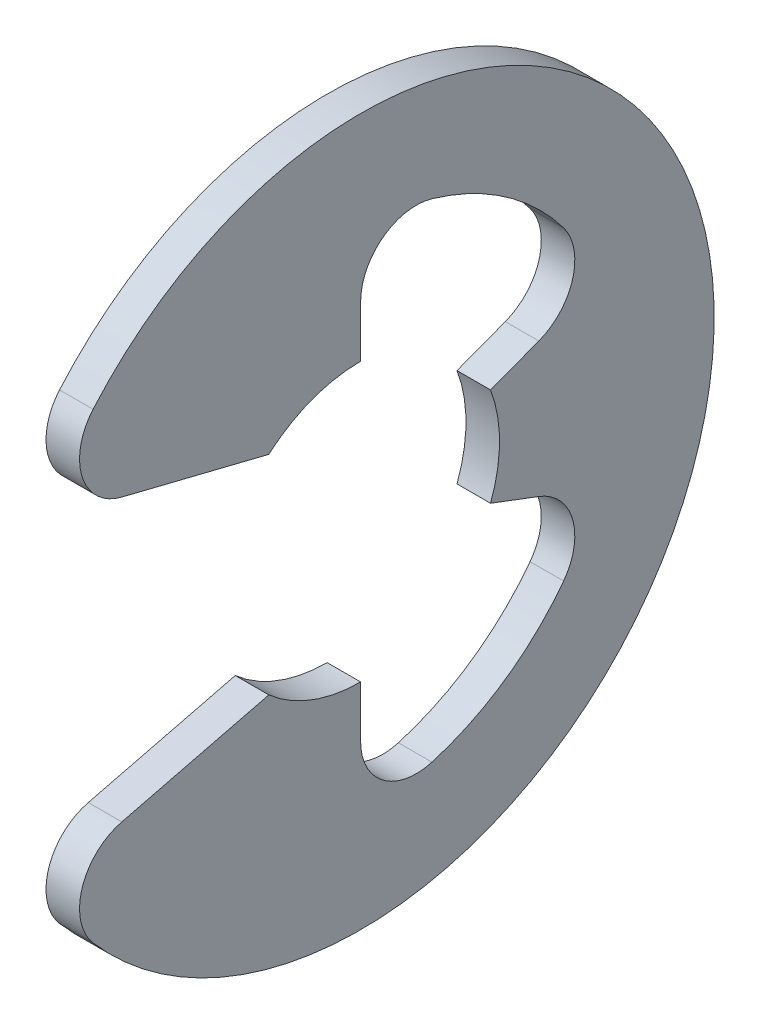
ISO-10303-21;
HEADER;
FILE_DESCRIPTION(('STEP AP214'),'2;1');
FILE_NAME('part.step','',(''),(''),'','','');
FILE_SCHEMA(('AUTOMOTIVE_DESIGN { 1 0 10303 214 1 1 1 1 }'));
ENDSEC;
DATA;
#1=APPLICATION_CONTEXT('core data for automotive mechanical design processes');
#2=APPLICATION_PROTOCOL_DEFINITION('international standard','automotive_design',2000,#1);
#3=PRODUCT_CONTEXT('',#1,'mechanical');
#4=PRODUCT('Part','Part','',(#3));
#5=PRODUCT_RELATED_PRODUCT_CATEGORY('part','',(#4));
#6=PRODUCT_DEFINITION_FORMATION('','',#4);
#7=PRODUCT_DEFINITION_CONTEXT('part definition',#1,'design');
#8=PRODUCT_DEFINITION('design','',#6,#7);
#9=PRODUCT_DEFINITION_SHAPE('','',#8);
#10=(LENGTH_UNIT() NAMED_UNIT(*) SI_UNIT(.MILLI.,.METRE.));
#11=(NAMED_UNIT(*) PLANE_ANGLE_UNIT() SI_UNIT($,.RADIAN.));
#12=(NAMED_UNIT(*) SI_UNIT($,.STERADIAN.) SOLID_ANGLE_UNIT());
#13=UNCERTAINTY_MEASURE_WITH_UNIT(LENGTH_MEASURE(1.E-05),#10,'distance_accuracy_value','');
#14=(GEOMETRIC_REPRESENTATION_CONTEXT(3) GLOBAL_UNCERTAINTY_ASSIGNED_CONTEXT((#13)) GLOBAL_UNIT_ASSIGNED_CONTEXT((#10,
#11,#12)) REPRESENTATION_CONTEXT('',''));
#15=CARTESIAN_POINT('',(0.,0.,0.));
#16=DIRECTION('',(0.,0.,1.));
#17=DIRECTION('',(1.,0.,0.));
#18=AXIS2_PLACEMENT_3D('',#15,#16,#17);
#19=CARTESIAN_POINT('',(0.3175,0.,0.));
#20=DIRECTION('',(-1.,0.,0.));
#21=DIRECTION('',(0.,0.,1.));
#22=AXIS2_PLACEMENT_3D('',#19,#20,#21);
#23=CYLINDRICAL_SURFACE('',#22,6.6929);
#24=CARTESIAN_POINT('',(0.3175,0.,0.));
#25=DIRECTION('',(1.,0.,0.));
#26=DIRECTION('',(0.,0.,-1.));
#27=AXIS2_PLACEMENT_3D('',#24,#25,#26);
#28=CIRCLE('',#27,6.6929);
#29=CARTESIAN_POINT('',(0.3175,-4.37455604641562,5.06538940327084));
#30=VERTEX_POINT('',#29);
#31=CARTESIAN_POINT('',(0.3175,4.37455604641561,5.06538940327085));
#32=VERTEX_POINT('',#31);
#33=EDGE_CURVE('E173',#30,#32,#28,.T.);
#34=ORIENTED_EDGE('',*,*,#33,.F.);
#35=DIRECTION('',(-1.,0.,0.));
#36=VECTOR('',#35,1.);
#37=CARTESIAN_POINT('',(0.3175,-4.37455604641562,5.06538940327085));
#38=LINE('',#37,#36);
#39=CARTESIAN_POINT('',(-0.3175,-4.37455604641562,5.06538940327084));
#40=VERTEX_POINT('',#39);
#41=EDGE_CURVE('E267',#30,#40,#38,.T.);
#42=ORIENTED_EDGE('',*,*,#41,.T.);
#43=CARTESIAN_POINT('',(-0.3175,0.,0.));
#44=DIRECTION('',(1.,0.,0.));
#45=DIRECTION('',(0.,0.,-1.));
#46=AXIS2_PLACEMENT_3D('',#43,#44,#45);
#47=CIRCLE('',#46,6.6929);
#48=CARTESIAN_POINT('',(-0.3175,4.37455604641561,5.06538940327085));
#49=VERTEX_POINT('',#48);
#50=EDGE_CURVE('E211',#40,#49,#47,.T.);
#51=ORIENTED_EDGE('',*,*,#50,.T.);
#52=DIRECTION('',(-1.,0.,0.));
#53=VECTOR('',#52,1.);
#54=CARTESIAN_POINT('',(0.3175,4.37455604641561,5.06538940327085));
#55=LINE('',#54,#53);
#56=EDGE_CURVE('E265',#49,#32,#55,.F.);
#57=ORIENTED_EDGE('',*,*,#56,.T.);
#58=EDGE_LOOP('',(#34,#42,#51,#57));
#59=FACE_BOUND('',#58,.T.);
#60=ADVANCED_FACE('F35',(#59),#23,.T.);
#61=CARTESIAN_POINT('',(0.3175,3.02251427254246,5.97154233697435));
#62=DIRECTION('',(0.,0.970536829925373,-0.240952820606873));
#63=DIRECTION('',(0.,0.240952820606873,0.970536829925373));
#64=AXIS2_PLACEMENT_3D('',#61,#62,#63);
#65=PLANE('',#64);
#66=DIRECTION('',(0.,-0.240952820606873,-0.970536829925373));
#67=VECTOR('',#66,1.);
#68=CARTESIAN_POINT('',(0.3175,3.02251427254246,5.97154233697435));
#69=LINE('',#68,#67);
#70=CARTESIAN_POINT('',(0.3175,2.66254134884423,4.52160296981889));
#71=VERTEX_POINT('',#70);
#72=CARTESIAN_POINT('',(0.3175,1.971675,1.73885390541443));
#73=VERTEX_POINT('',#72);
#74=EDGE_CURVE('E159',#71,#73,#69,.T.);
#75=ORIENTED_EDGE('',*,*,#74,.F.);
#76=DIRECTION('',(-1.,0.,0.));
#77=VECTOR('',#76,1.);
#78=CARTESIAN_POINT('',(0.3175,2.66254134884423,4.52160296981889));
#79=LINE('',#78,#77);
#80=CARTESIAN_POINT('',(-0.3175,2.66254134884423,4.52160296981889));
#81=VERTEX_POINT('',#80);
#82=EDGE_CURVE('E279',#71,#81,#79,.T.);
#83=ORIENTED_EDGE('',*,*,#82,.T.);
#84=DIRECTION('',(0.,-0.240952820606873,-0.970536829925373));
#85=VECTOR('',#84,1.);
#86=CARTESIAN_POINT('',(-0.3175,3.02251427254246,5.97154233697435));
#87=LINE('',#86,#85);
#88=CARTESIAN_POINT('',(-0.3175,1.971675,1.73885390541443));
#89=VERTEX_POINT('',#88);
#90=EDGE_CURVE('E179',#81,#89,#87,.T.);
#91=ORIENTED_EDGE('',*,*,#90,.T.);
#92=DIRECTION('',(-1.,0.,0.));
#93=VECTOR('',#92,1.);
#94=CARTESIAN_POINT('',(0.3175,1.971675,1.73885390541443));
#95=LINE('',#94,#93);
#96=EDGE_CURVE('E176',#73,#89,#95,.T.);
#97=ORIENTED_EDGE('',*,*,#96,.F.);
#98=EDGE_LOOP('',(#75,#83,#91,#97));
#99=FACE_BOUND('',#98,.T.);
#100=ADVANCED_FACE('F177',(#99),#65,.F.);
#101=CARTESIAN_POINT('',(0.3175,0.,0.));
#102=DIRECTION('',(-1.,0.,0.));
#103=DIRECTION('',(0.,0.,1.));
#104=AXIS2_PLACEMENT_3D('',#101,#102,#103);
#105=CYLINDRICAL_SURFACE('',#104,2.6289);
#106=CARTESIAN_POINT('',(-0.3175,0.,0.));
#107=DIRECTION('',(-1.,0.,0.));
#108=DIRECTION('',(0.,0.,1.));
#109=AXIS2_PLACEMENT_3D('',#106,#107,#108);
#110=CIRCLE('',#109,2.6289);
#111=CARTESIAN_POINT('',(-0.3175,2.6289,0.));
#112=VERTEX_POINT('',#111);
#113=EDGE_CURVE('E215',#89,#112,#110,.T.);
#114=ORIENTED_EDGE('',*,*,#113,.T.);
#115=DIRECTION('',(-1.,0.,0.));
#116=VECTOR('',#115,1.);
#117=CARTESIAN_POINT('',(0.3175,2.6289,0.));
#118=LINE('',#117,#116);
#119=CARTESIAN_POINT('',(0.3175,2.6289,0.));
#120=VERTEX_POINT('',#119);
#121=EDGE_CURVE('E183',#120,#112,#118,.T.);
#122=ORIENTED_EDGE('',*,*,#121,.F.);
#123=CARTESIAN_POINT('',(0.3175,0.,0.));
#124=DIRECTION('',(-1.,0.,0.));
#125=DIRECTION('',(0.,0.,1.));
#126=AXIS2_PLACEMENT_3D('',#123,#124,#125);
#127=CIRCLE('',#126,2.6289);
#128=EDGE_CURVE('E165',#73,#120,#127,.T.);
#129=ORIENTED_EDGE('',*,*,#128,.F.);
#130=ORIENTED_EDGE('',*,*,#96,.T.);
#131=EDGE_LOOP('',(#114,#122,#129,#130));
#132=FACE_BOUND('',#131,.T.);
#133=ADVANCED_FACE('F185',(#132),#105,.F.);
#134=CARTESIAN_POINT('',(0.3175,2.6289,0.));
#135=DIRECTION('',(0.,0.,1.));
#136=DIRECTION('',(0.,-1.,0.));
#137=AXIS2_PLACEMENT_3D('',#134,#135,#136);
#138=PLANE('',#137);
#139=DIRECTION('',(0.,1.,0.));
#140=VECTOR('',#139,1.);
#141=CARTESIAN_POINT('',(-0.3175,2.6289,0.));
#142=LINE('',#141,#140);
#143=CARTESIAN_POINT('',(-0.3175,3.60625310153646,0.));
#144=VERTEX_POINT('',#143);
#145=EDGE_CURVE('E217',#112,#144,#142,.T.);
#146=ORIENTED_EDGE('',*,*,#145,.T.);
#147=DIRECTION('',(1.,0.,0.));
#148=VECTOR('',#147,1.);
#149=CARTESIAN_POINT('',(0.3175,3.60625310153646,0.));
#150=LINE('',#149,#148);
#151=CARTESIAN_POINT('',(0.3175,3.60625310153646,0.));
#152=VERTEX_POINT('',#151);
#153=EDGE_CURVE('E263',#144,#152,#150,.T.);
#154=ORIENTED_EDGE('',*,*,#153,.T.);
#155=DIRECTION('',(0.,1.,0.));
#156=VECTOR('',#155,1.);
#157=CARTESIAN_POINT('',(0.3175,2.6289,0.));
#158=LINE('',#157,#156);
#159=EDGE_CURVE('E188',#120,#152,#158,.T.);
#160=ORIENTED_EDGE('',*,*,#159,.F.);
#161=ORIENTED_EDGE('',*,*,#121,.T.);
#162=EDGE_LOOP('',(#146,#154,#160,#161));
#163=FACE_BOUND('',#162,.T.);
#164=ADVANCED_FACE('F385',(#163),#138,.F.);
#165=CARTESIAN_POINT('',(0.3175,0.,0.));
#166=DIRECTION('',(-1.,0.,0.));
#167=DIRECTION('',(0.,0.,1.));
#168=AXIS2_PLACEMENT_3D('',#165,#166,#167);
#169=CYLINDRICAL_SURFACE('',#168,4.81125161290323);
#170=CARTESIAN_POINT('',(0.3175,0.,0.));
#171=DIRECTION('',(-1.,0.,0.));
#172=DIRECTION('',(0.,0.,-1.));
#173=AXIS2_PLACEMENT_3D('',#170,#171,#172);
#174=CIRCLE('',#173,4.81125161290323);
#175=CARTESIAN_POINT('',(0.3175,4.61801727450051,-1.34983648457093));
#176=VERTEX_POINT('',#175);
#177=CARTESIAN_POINT('',(0.3175,2.89537207857591,-3.84252034597956));
#178=VERTEX_POINT('',#177);
#179=EDGE_CURVE('E190',#176,#178,#174,.T.);
#180=ORIENTED_EDGE('',*,*,#179,.F.);
#181=DIRECTION('',(-1.,0.,0.));
#182=VECTOR('',#181,1.);
#183=CARTESIAN_POINT('',(0.3175,4.61801727450051,-1.34983648457093));
#184=LINE('',#183,#182);
#185=CARTESIAN_POINT('',(-0.3175,4.61801727450051,-1.34983648457093));
#186=VERTEX_POINT('',#185);
#187=EDGE_CURVE('E260',#176,#186,#184,.T.);
#188=ORIENTED_EDGE('',*,*,#187,.T.);
#189=CARTESIAN_POINT('',(-0.3175,0.,0.));
#190=DIRECTION('',(-1.,0.,0.));
#191=DIRECTION('',(0.,0.,-1.));
#192=AXIS2_PLACEMENT_3D('',#189,#190,#191);
#193=CIRCLE('',#192,4.81125161290323);
#194=CARTESIAN_POINT('',(-0.3175,2.89537207857591,-3.84252034597956));
#195=VERTEX_POINT('',#194);
#196=EDGE_CURVE('E220',#186,#195,#193,.T.);
#197=ORIENTED_EDGE('',*,*,#196,.T.);
#198=DIRECTION('',(-1.,0.,0.));
#199=VECTOR('',#198,1.);
#200=CARTESIAN_POINT('',(0.3175,2.89537207857591,-3.84252034597956));
#201=LINE('',#200,#199);
#202=EDGE_CURVE('E258',#195,#178,#201,.F.);
#203=ORIENTED_EDGE('',*,*,#202,.T.);
#204=EDGE_LOOP('',(#180,#188,#197,#203));
#205=FACE_BOUND('',#204,.T.);
#206=ADVANCED_FACE('F307',(#205),#169,.F.);
#207=CARTESIAN_POINT('',(0.3175,0.929456508530657,-2.4591107760225));
#208=DIRECTION('',(0.,-0.935414346693485,-0.353553390593274));
#209=DIRECTION('',(0.,0.353553390593274,-0.935414346693485));
#210=AXIS2_PLACEMENT_3D('',#207,#208,#209);
#211=PLANE('',#210);
#212=DIRECTION('',(0.,-0.353553390593274,0.935414346693485));
#213=VECTOR('',#212,1.);
#214=CARTESIAN_POINT('',(0.3175,0.929456508530657,-2.4591107760225));
#215=LINE('',#214,#213);
#216=CARTESIAN_POINT('',(0.3175,1.27500301138572,-3.37334088898508));
#217=VERTEX_POINT('',#216);
#218=CARTESIAN_POINT('',(0.3175,0.929456508530657,-2.4591107760225));
#219=VERTEX_POINT('',#218);
#220=EDGE_CURVE('E195',#217,#219,#215,.T.);
#221=ORIENTED_EDGE('',*,*,#220,.F.);
#222=DIRECTION('',(1.,0.,0.));
#223=VECTOR('',#222,1.);
#224=CARTESIAN_POINT('',(-0.3175,1.27500301138572,-3.37334088898508));
#225=LINE('',#224,#223);
#226=CARTESIAN_POINT('',(-0.3175,1.27500301138572,-3.37334088898508));
#227=VERTEX_POINT('',#226);
#228=EDGE_CURVE('E282',#217,#227,#225,.F.);
#229=ORIENTED_EDGE('',*,*,#228,.T.);
#230=DIRECTION('',(0.,-0.353553390593274,0.935414346693485));
#231=VECTOR('',#230,1.);
#232=CARTESIAN_POINT('',(-0.3175,0.929456508530657,-2.4591107760225));
#233=LINE('',#232,#231);
#234=CARTESIAN_POINT('',(-0.3175,0.929456508530657,-2.4591107760225));
#235=VERTEX_POINT('',#234);
#236=EDGE_CURVE('E223',#227,#235,#233,.T.);
#237=ORIENTED_EDGE('',*,*,#236,.T.);
#238=DIRECTION('',(-1.,0.,0.));
#239=VECTOR('',#238,1.);
#240=CARTESIAN_POINT('',(0.3175,0.929456508530657,-2.4591107760225));
#241=LINE('',#240,#239);
#242=EDGE_CURVE('E247',#219,#235,#241,.T.);
#243=ORIENTED_EDGE('',*,*,#242,.F.);
#244=EDGE_LOOP('',(#221,#229,#237,#243));
#245=FACE_BOUND('',#244,.T.);
#246=ADVANCED_FACE('F310',(#245),#211,.F.);
#247=CARTESIAN_POINT('',(0.3175,0.,0.));
#248=DIRECTION('',(-1.,0.,0.));
#249=DIRECTION('',(0.,0.,1.));
#250=AXIS2_PLACEMENT_3D('',#247,#248,#249);
#251=CYLINDRICAL_SURFACE('',#250,2.6289);
#252=CARTESIAN_POINT('',(-0.3175,0.,0.));
#253=DIRECTION('',(-1.,0.,0.));
#254=DIRECTION('',(0.,0.,1.));
#255=AXIS2_PLACEMENT_3D('',#252,#253,#254);
#256=CIRCLE('',#255,2.6289);
#257=CARTESIAN_POINT('',(-0.3175,-0.929456508530656,-2.4591107760225));
#258=VERTEX_POINT('',#257);
#259=EDGE_CURVE('E225',#235,#258,#256,.T.);
#260=ORIENTED_EDGE('',*,*,#259,.T.);
#261=DIRECTION('',(-1.,0.,0.));
#262=VECTOR('',#261,1.);
#263=CARTESIAN_POINT('',(0.3175,-0.929456508530656,-2.4591107760225));
#264=LINE('',#263,#262);
#265=CARTESIAN_POINT('',(0.3175,-0.929456508530656,-2.4591107760225));
#266=VERTEX_POINT('',#265);
#267=EDGE_CURVE('E244',#266,#258,#264,.T.);
#268=ORIENTED_EDGE('',*,*,#267,.F.);
#269=CARTESIAN_POINT('',(0.3175,0.,0.));
#270=DIRECTION('',(-1.,0.,0.));
#271=DIRECTION('',(0.,0.,1.));
#272=AXIS2_PLACEMENT_3D('',#269,#270,#271);
#273=CIRCLE('',#272,2.6289);
#274=EDGE_CURVE('E197',#219,#266,#273,.T.);
#275=ORIENTED_EDGE('',*,*,#274,.F.);
#276=ORIENTED_EDGE('',*,*,#242,.T.);
#277=EDGE_LOOP('',(#260,#268,#275,#276));
#278=FACE_BOUND('',#277,.T.);
#279=ADVANCED_FACE('F316',(#278),#251,.F.);
#280=CARTESIAN_POINT('',(0.3175,-0.929456508530656,-2.4591107760225));
#281=DIRECTION('',(0.,0.935414346693486,-0.353553390593273));
#282=DIRECTION('',(0.,0.353553390593273,0.935414346693486));
#283=AXIS2_PLACEMENT_3D('',#280,#281,#282);
#284=PLANE('',#283);
#285=DIRECTION('',(0.,-0.353553390593273,-0.935414346693485));
#286=VECTOR('',#285,1.);
#287=CARTESIAN_POINT('',(-0.3175,-0.929456508530656,-2.4591107760225));
#288=LINE('',#287,#286);
#289=CARTESIAN_POINT('',(-0.3175,-1.27500301138572,-3.37334088898508));
#290=VERTEX_POINT('',#289);
#291=EDGE_CURVE('E227',#258,#290,#288,.T.);
#292=ORIENTED_EDGE('',*,*,#291,.T.);
#293=DIRECTION('',(1.,0.,0.));
#294=VECTOR('',#293,1.);
#295=CARTESIAN_POINT('',(0.3175,-1.27500301138572,-3.37334088898508));
#296=LINE('',#295,#294);
#297=CARTESIAN_POINT('',(0.3175,-1.27500301138572,-3.37334088898508));
#298=VERTEX_POINT('',#297);
#299=EDGE_CURVE('E50',#290,#298,#296,.T.);
#300=ORIENTED_EDGE('',*,*,#299,.T.);
#301=DIRECTION('',(0.,-0.353553390593273,-0.935414346693485));
#302=VECTOR('',#301,1.);
#303=CARTESIAN_POINT('',(0.3175,-0.929456508530656,-2.4591107760225));
#304=LINE('',#303,#302);
#305=EDGE_CURVE('E199',#266,#298,#304,.T.);
#306=ORIENTED_EDGE('',*,*,#305,.F.);
#307=ORIENTED_EDGE('',*,*,#267,.T.);
#308=EDGE_LOOP('',(#292,#300,#306,#307));
#309=FACE_BOUND('',#308,.T.);
#310=ADVANCED_FACE('F318',(#309),#284,.F.);
#311=CARTESIAN_POINT('',(0.3175,0.,0.));
#312=DIRECTION('',(-1.,0.,0.));
#313=DIRECTION('',(0.,0.,1.));
#314=AXIS2_PLACEMENT_3D('',#311,#312,#313);
#315=CYLINDRICAL_SURFACE('',#314,4.81125161290323);
#316=CARTESIAN_POINT('',(-0.3175,0.,0.));
#317=DIRECTION('',(-1.,0.,0.));
#318=DIRECTION('',(0.,0.,-1.));
#319=AXIS2_PLACEMENT_3D('',#316,#317,#318);
#320=CIRCLE('',#319,4.81125161290323);
#321=CARTESIAN_POINT('',(-0.3175,-2.89537207857591,-3.84252034597956));
#322=VERTEX_POINT('',#321);
#323=CARTESIAN_POINT('',(-0.3175,-4.61801727450051,-1.34983648457093));
#324=VERTEX_POINT('',#323);
#325=EDGE_CURVE('E229',#322,#324,#320,.T.);
#326=ORIENTED_EDGE('',*,*,#325,.T.);
#327=DIRECTION('',(-1.,0.,0.));
#328=VECTOR('',#327,1.);
#329=CARTESIAN_POINT('',(0.3175,-4.61801727450051,-1.34983648457093));
#330=LINE('',#329,#328);
#331=CARTESIAN_POINT('',(0.3175,-4.61801727450051,-1.34983648457093));
#332=VERTEX_POINT('',#331);
#333=EDGE_CURVE('E256',#324,#332,#330,.F.);
#334=ORIENTED_EDGE('',*,*,#333,.T.);
#335=CARTESIAN_POINT('',(0.3175,0.,0.));
#336=DIRECTION('',(-1.,0.,0.));
#337=DIRECTION('',(0.,0.,-1.));
#338=AXIS2_PLACEMENT_3D('',#335,#336,#337);
#339=CIRCLE('',#338,4.81125161290323);
#340=CARTESIAN_POINT('',(0.3175,-2.89537207857591,-3.84252034597956));
#341=VERTEX_POINT('',#340);
#342=EDGE_CURVE('E201',#341,#332,#339,.T.);
#343=ORIENTED_EDGE('',*,*,#342,.F.);
#344=DIRECTION('',(-1.,0.,0.));
#345=VECTOR('',#344,1.);
#346=CARTESIAN_POINT('',(0.3175,-2.89537207857591,-3.84252034597956));
#347=LINE('',#346,#345);
#348=EDGE_CURVE('E253',#341,#322,#347,.T.);
#349=ORIENTED_EDGE('',*,*,#348,.T.);
#350=EDGE_LOOP('',(#326,#334,#343,#349));
#351=FACE_BOUND('',#350,.T.);
#352=ADVANCED_FACE('F320',(#351),#315,.F.);
#353=CARTESIAN_POINT('',(0.3175,-2.6289,0.));
#354=DIRECTION('',(0.,0.,1.));
#355=DIRECTION('',(0.,-1.,0.));
#356=AXIS2_PLACEMENT_3D('',#353,#354,#355);
#357=PLANE('',#356);
#358=DIRECTION('',(0.,1.,0.));
#359=VECTOR('',#358,1.);
#360=CARTESIAN_POINT('',(0.3175,-2.6289,0.));
#361=LINE('',#360,#359);
#362=CARTESIAN_POINT('',(0.3175,-3.60625310153646,0.));
#363=VERTEX_POINT('',#362);
#364=CARTESIAN_POINT('',(0.3175,-2.6289,0.));
#365=VERTEX_POINT('',#364);
#366=EDGE_CURVE('E204',#363,#365,#361,.T.);
#367=ORIENTED_EDGE('',*,*,#366,.F.);
#368=DIRECTION('',(1.,0.,0.));
#369=VECTOR('',#368,1.);
#370=CARTESIAN_POINT('',(-0.3175,-3.60625310153646,0.));
#371=LINE('',#370,#369);
#372=CARTESIAN_POINT('',(-0.3175,-3.60625310153646,0.));
#373=VERTEX_POINT('',#372);
#374=EDGE_CURVE('E182',#363,#373,#371,.F.);
#375=ORIENTED_EDGE('',*,*,#374,.T.);
#376=DIRECTION('',(0.,1.,0.));
#377=VECTOR('',#376,1.);
#378=CARTESIAN_POINT('',(-0.3175,-2.6289,0.));
#379=LINE('',#378,#377);
#380=CARTESIAN_POINT('',(-0.3175,-2.6289,0.));
#381=VERTEX_POINT('',#380);
#382=EDGE_CURVE('E232',#373,#381,#379,.T.);
#383=ORIENTED_EDGE('',*,*,#382,.T.);
#384=DIRECTION('',(-1.,0.,0.));
#385=VECTOR('',#384,1.);
#386=CARTESIAN_POINT('',(0.3175,-2.6289,0.));
#387=LINE('',#386,#385);
#388=EDGE_CURVE('E241',#365,#381,#387,.T.);
#389=ORIENTED_EDGE('',*,*,#388,.F.);
#390=EDGE_LOOP('',(#367,#375,#383,#389));
#391=FACE_BOUND('',#390,.T.);
#392=ADVANCED_FACE('F326',(#391),#357,.F.);
#393=CARTESIAN_POINT('',(0.3175,0.,0.));
#394=DIRECTION('',(-1.,0.,0.));
#395=DIRECTION('',(0.,0.,1.));
#396=AXIS2_PLACEMENT_3D('',#393,#394,#395);
#397=CYLINDRICAL_SURFACE('',#396,2.6289);
#398=CARTESIAN_POINT('',(-0.3175,0.,0.));
#399=DIRECTION('',(-1.,0.,0.));
#400=DIRECTION('',(0.,0.,-1.));
#401=AXIS2_PLACEMENT_3D('',#398,#399,#400);
#402=CIRCLE('',#401,2.6289);
#403=CARTESIAN_POINT('',(-0.3175,-1.971675,1.73885390541443));
#404=VERTEX_POINT('',#403);
#405=EDGE_CURVE('E234',#381,#404,#402,.T.);
#406=ORIENTED_EDGE('',*,*,#405,.T.);
#407=DIRECTION('',(-1.,0.,0.));
#408=VECTOR('',#407,1.);
#409=CARTESIAN_POINT('',(0.3175,-1.971675,1.73885390541443));
#410=LINE('',#409,#408);
#411=CARTESIAN_POINT('',(0.3175,-1.971675,1.73885390541443));
#412=VERTEX_POINT('',#411);
#413=EDGE_CURVE('E210',#412,#404,#410,.T.);
#414=ORIENTED_EDGE('',*,*,#413,.F.);
#415=CARTESIAN_POINT('',(0.3175,0.,0.));
#416=DIRECTION('',(-1.,0.,0.));
#417=DIRECTION('',(0.,0.,-1.));
#418=AXIS2_PLACEMENT_3D('',#415,#416,#417);
#419=CIRCLE('',#418,2.6289);
#420=EDGE_CURVE('E206',#365,#412,#419,.T.);
#421=ORIENTED_EDGE('',*,*,#420,.F.);
#422=ORIENTED_EDGE('',*,*,#388,.T.);
#423=EDGE_LOOP('',(#406,#414,#421,#422));
#424=FACE_BOUND('',#423,.T.);
#425=ADVANCED_FACE('F375',(#424),#397,.F.);
#426=CARTESIAN_POINT('',(0.3175,-3.02251427254246,5.97154233697435));
#427=DIRECTION('',(0.,-0.970536829925373,-0.240952820606873));
#428=DIRECTION('',(0.,0.240952820606873,-0.970536829925373));
#429=AXIS2_PLACEMENT_3D('',#426,#427,#428);
#430=PLANE('',#429);
#431=DIRECTION('',(0.,-0.240952820606873,0.970536829925373));
#432=VECTOR('',#431,1.);
#433=CARTESIAN_POINT('',(-0.3175,-3.02251427254246,5.97154233697435));
#434=LINE('',#433,#432);
#435=CARTESIAN_POINT('',(-0.3175,-2.66254134884423,4.52160296981889));
#436=VERTEX_POINT('',#435);
#437=EDGE_CURVE('E236',#404,#436,#434,.T.);
#438=ORIENTED_EDGE('',*,*,#437,.T.);
#439=DIRECTION('',(-1.,0.,0.));
#440=VECTOR('',#439,1.);
#441=CARTESIAN_POINT('',(0.3175,-2.66254134884423,4.52160296981889));
#442=LINE('',#441,#440);
#443=CARTESIAN_POINT('',(0.3175,-2.66254134884423,4.52160296981889));
#444=VERTEX_POINT('',#443);
#445=EDGE_CURVE('E274',#436,#444,#442,.F.);
#446=ORIENTED_EDGE('',*,*,#445,.T.);
#447=DIRECTION('',(0.,-0.240952820606873,0.970536829925373));
#448=VECTOR('',#447,1.);
#449=CARTESIAN_POINT('',(0.3175,-3.02251427254246,5.97154233697435));
#450=LINE('',#449,#448);
#451=EDGE_CURVE('E208',#412,#444,#450,.T.);
#452=ORIENTED_EDGE('',*,*,#451,.F.);
#453=ORIENTED_EDGE('',*,*,#413,.T.);
#454=EDGE_LOOP('',(#438,#446,#452,#453));
#455=FACE_BOUND('',#454,.T.);
#456=ADVANCED_FACE('F417',(#455),#430,.F.);
#457=CARTESIAN_POINT('',(0.3175,0.,0.));
#458=DIRECTION('',(1.,0.,0.));
#459=DIRECTION('',(0.,0.,-1.));
#460=AXIS2_PLACEMENT_3D('',#457,#458,#459);
#461=PLANE('',#460);
#462=ORIENTED_EDGE('',*,*,#451,.T.);
#463=CARTESIAN_POINT('',(0.3175,-3.68558422126856,4.26761460161718));
#464=DIRECTION('',(1.,0.,0.));
#465=DIRECTION('',(0.,0.,-1.));
#466=AXIS2_PLACEMENT_3D('',#463,#464,#465);
#467=CIRCLE('',#466,1.0541);
#468=EDGE_CURVE('E277',#444,#30,#467,.T.);
#469=ORIENTED_EDGE('',*,*,#468,.T.);
#470=ORIENTED_EDGE('',*,*,#33,.T.);
#471=CARTESIAN_POINT('',(0.3175,3.68558422126856,4.26761460161718));
#472=DIRECTION('',(1.,0.,0.));
#473=DIRECTION('',(0.,0.,-1.));
#474=AXIS2_PLACEMENT_3D('',#471,#472,#473);
#475=CIRCLE('',#474,1.0541);
#476=EDGE_CURVE('E169',#32,#71,#475,.T.);
#477=ORIENTED_EDGE('',*,*,#476,.T.);
#478=ORIENTED_EDGE('',*,*,#74,.T.);
#479=ORIENTED_EDGE('',*,*,#128,.T.);
#480=ORIENTED_EDGE('',*,*,#159,.T.);
#481=CARTESIAN_POINT('',(0.3175,3.60625310153646,-1.0541));
#482=DIRECTION('',(1.,0.,0.));
#483=DIRECTION('',(0.,0.,-1.));
#484=AXIS2_PLACEMENT_3D('',#481,#482,#483);
#485=CIRCLE('',#484,1.0541);
#486=EDGE_CURVE('E291',#152,#176,#485,.F.);
#487=ORIENTED_EDGE('',*,*,#486,.T.);
#488=ORIENTED_EDGE('',*,*,#179,.T.);
#489=CARTESIAN_POINT('',(0.3175,2.26102327423533,-3.00066025996071));
#490=DIRECTION('',(1.,0.,0.));
#491=DIRECTION('',(0.,0.,-1.));
#492=AXIS2_PLACEMENT_3D('',#489,#490,#491);
#493=CIRCLE('',#492,1.0541);
#494=EDGE_CURVE('E11',#178,#217,#493,.F.);
#495=ORIENTED_EDGE('',*,*,#494,.T.);
#496=ORIENTED_EDGE('',*,*,#220,.T.);
#497=ORIENTED_EDGE('',*,*,#274,.T.);
#498=ORIENTED_EDGE('',*,*,#305,.T.);
#499=CARTESIAN_POINT('',(0.3175,-2.26102327423533,-3.00066025996071));
#500=DIRECTION('',(1.,0.,0.));
#501=DIRECTION('',(0.,0.,-1.));
#502=AXIS2_PLACEMENT_3D('',#499,#500,#501);
#503=CIRCLE('',#502,1.0541);
#504=EDGE_CURVE('E295',#298,#341,#503,.F.);
#505=ORIENTED_EDGE('',*,*,#504,.T.);
#506=ORIENTED_EDGE('',*,*,#342,.T.);
#507=CARTESIAN_POINT('',(0.3175,-3.60625310153646,-1.0541));
#508=DIRECTION('',(1.,0.,0.));
#509=DIRECTION('',(0.,0.,-1.));
#510=AXIS2_PLACEMENT_3D('',#507,#508,#509);
#511=CIRCLE('',#510,1.0541);
#512=EDGE_CURVE('E287',#332,#363,#511,.F.);
#513=ORIENTED_EDGE('',*,*,#512,.T.);
#514=ORIENTED_EDGE('',*,*,#366,.T.);
#515=ORIENTED_EDGE('',*,*,#420,.T.);
#516=EDGE_LOOP('',(#462,#469,#470,#477,#478,#479,#480,#487,#488,#495,#496,#497,#498,#505,#506,
#513,#514,#515));
#517=FACE_BOUND('',#516,.T.);
#518=ADVANCED_FACE('F162',(#517),#461,.T.);
#519=CARTESIAN_POINT('',(-0.3175,0.,0.));
#520=DIRECTION('',(1.,0.,0.));
#521=DIRECTION('',(0.,0.,-1.));
#522=AXIS2_PLACEMENT_3D('',#519,#520,#521);
#523=PLANE('',#522);
#524=ORIENTED_EDGE('',*,*,#50,.F.);
#525=CARTESIAN_POINT('',(-0.3175,-3.68558422126856,4.26761460161718));
#526=DIRECTION('',(1.,0.,0.));
#527=DIRECTION('',(0.,0.,-1.));
#528=AXIS2_PLACEMENT_3D('',#525,#526,#527);
#529=CIRCLE('',#528,1.0541);
#530=EDGE_CURVE('E272',#40,#436,#529,.F.);
#531=ORIENTED_EDGE('',*,*,#530,.T.);
#532=ORIENTED_EDGE('',*,*,#437,.F.);
#533=ORIENTED_EDGE('',*,*,#405,.F.);
#534=ORIENTED_EDGE('',*,*,#382,.F.);
#535=CARTESIAN_POINT('',(-0.3175,-3.60625310153646,-1.0541));
#536=DIRECTION('',(1.,0.,0.));
#537=DIRECTION('',(0.,0.,-1.));
#538=AXIS2_PLACEMENT_3D('',#535,#536,#537);
#539=CIRCLE('',#538,1.0541);
#540=EDGE_CURVE('E285',#373,#324,#539,.T.);
#541=ORIENTED_EDGE('',*,*,#540,.T.);
#542=ORIENTED_EDGE('',*,*,#325,.F.);
#543=CARTESIAN_POINT('',(-0.3175,-2.26102327423533,-3.00066025996071));
#544=DIRECTION('',(1.,0.,0.));
#545=DIRECTION('',(0.,0.,-1.));
#546=AXIS2_PLACEMENT_3D('',#543,#544,#545);
#547=CIRCLE('',#546,1.0541);
#548=EDGE_CURVE('E293',#322,#290,#547,.T.);
#549=ORIENTED_EDGE('',*,*,#548,.T.);
#550=ORIENTED_EDGE('',*,*,#291,.F.);
#551=ORIENTED_EDGE('',*,*,#259,.F.);
#552=ORIENTED_EDGE('',*,*,#236,.F.);
#553=CARTESIAN_POINT('',(-0.3175,2.26102327423533,-3.00066025996071));
#554=DIRECTION('',(1.,0.,0.));
#555=DIRECTION('',(0.,0.,-1.));
#556=AXIS2_PLACEMENT_3D('',#553,#554,#555);
#557=CIRCLE('',#556,1.0541);
#558=EDGE_CURVE('E43',#227,#195,#557,.T.);
#559=ORIENTED_EDGE('',*,*,#558,.T.);
#560=ORIENTED_EDGE('',*,*,#196,.F.);
#561=CARTESIAN_POINT('',(-0.3175,3.60625310153646,-1.0541));
#562=DIRECTION('',(1.,0.,0.));
#563=DIRECTION('',(0.,0.,-1.));
#564=AXIS2_PLACEMENT_3D('',#561,#562,#563);
#565=CIRCLE('',#564,1.0541);
#566=EDGE_CURVE('E289',#186,#144,#565,.T.);
#567=ORIENTED_EDGE('',*,*,#566,.T.);
#568=ORIENTED_EDGE('',*,*,#145,.F.);
#569=ORIENTED_EDGE('',*,*,#113,.F.);
#570=ORIENTED_EDGE('',*,*,#90,.F.);
#571=CARTESIAN_POINT('',(-0.3175,3.68558422126856,4.26761460161718));
#572=DIRECTION('',(1.,0.,0.));
#573=DIRECTION('',(0.,0.,-1.));
#574=AXIS2_PLACEMENT_3D('',#571,#572,#573);
#575=CIRCLE('',#574,1.0541);
#576=EDGE_CURVE('E270',#81,#49,#575,.F.);
#577=ORIENTED_EDGE('',*,*,#576,.T.);
#578=EDGE_LOOP('',(#524,#531,#532,#533,#534,#541,#542,#549,#550,#551,#552,#559,#560,#567,#568,
#569,#570,#577));
#579=FACE_BOUND('',#578,.T.);
#580=ADVANCED_FACE('F300',(#579),#523,.F.);
#581=CARTESIAN_POINT('',(0.3175,-3.60625310153646,-1.0541));
#582=DIRECTION('',(-1.,0.,0.));
#583=DIRECTION('',(0.,0.,1.));
#584=AXIS2_PLACEMENT_3D('',#581,#582,#583);
#585=CYLINDRICAL_SURFACE('',#584,1.0541);
#586=ORIENTED_EDGE('',*,*,#512,.F.);
#587=ORIENTED_EDGE('',*,*,#333,.F.);
#588=ORIENTED_EDGE('',*,*,#540,.F.);
#589=ORIENTED_EDGE('',*,*,#374,.F.);
#590=EDGE_LOOP('',(#586,#587,#588,#589));
#591=FACE_BOUND('',#590,.T.);
#592=ADVANCED_FACE('F340',(#591),#585,.F.);
#593=CARTESIAN_POINT('',(0.3175,3.60625310153646,-1.0541));
#594=DIRECTION('',(-1.,0.,0.));
#595=DIRECTION('',(0.,0.,1.));
#596=AXIS2_PLACEMENT_3D('',#593,#594,#595);
#597=CYLINDRICAL_SURFACE('',#596,1.0541);
#598=ORIENTED_EDGE('',*,*,#486,.F.);
#599=ORIENTED_EDGE('',*,*,#153,.F.);
#600=ORIENTED_EDGE('',*,*,#566,.F.);
#601=ORIENTED_EDGE('',*,*,#187,.F.);
#602=EDGE_LOOP('',(#598,#599,#600,#601));
#603=FACE_BOUND('',#602,.T.);
#604=ADVANCED_FACE('F343',(#603),#597,.F.);
#605=CARTESIAN_POINT('',(0.3175,-3.68558422126856,4.26761460161718));
#606=DIRECTION('',(-1.,0.,0.));
#607=DIRECTION('',(0.,0.,1.));
#608=AXIS2_PLACEMENT_3D('',#605,#606,#607);
#609=CYLINDRICAL_SURFACE('',#608,1.0541);
#610=ORIENTED_EDGE('',*,*,#468,.F.);
#611=ORIENTED_EDGE('',*,*,#445,.F.);
#612=ORIENTED_EDGE('',*,*,#530,.F.);
#613=ORIENTED_EDGE('',*,*,#41,.F.);
#614=EDGE_LOOP('',(#610,#611,#612,#613));
#615=FACE_BOUND('',#614,.T.);
#616=ADVANCED_FACE('F347',(#615),#609,.T.);
#617=CARTESIAN_POINT('',(0.3175,3.68558422126856,4.26761460161718));
#618=DIRECTION('',(-1.,0.,0.));
#619=DIRECTION('',(0.,0.,1.));
#620=AXIS2_PLACEMENT_3D('',#617,#618,#619);
#621=CYLINDRICAL_SURFACE('',#620,1.0541);
#622=ORIENTED_EDGE('',*,*,#476,.F.);
#623=ORIENTED_EDGE('',*,*,#56,.F.);
#624=ORIENTED_EDGE('',*,*,#576,.F.);
#625=ORIENTED_EDGE('',*,*,#82,.F.);
#626=EDGE_LOOP('',(#622,#623,#624,#625));
#627=FACE_BOUND('',#626,.T.);
#628=ADVANCED_FACE('F351',(#627),#621,.T.);
#629=CARTESIAN_POINT('',(0.3175,-2.26102327423533,-3.00066025996071));
#630=DIRECTION('',(-1.,0.,0.));
#631=DIRECTION('',(0.,0.,1.));
#632=AXIS2_PLACEMENT_3D('',#629,#630,#631);
#633=CYLINDRICAL_SURFACE('',#632,1.0541);
#634=ORIENTED_EDGE('',*,*,#504,.F.);
#635=ORIENTED_EDGE('',*,*,#299,.F.);
#636=ORIENTED_EDGE('',*,*,#548,.F.);
#637=ORIENTED_EDGE('',*,*,#348,.F.);
#638=EDGE_LOOP('',(#634,#635,#636,#637));
#639=FACE_BOUND('',#638,.T.);
#640=ADVANCED_FACE('F354',(#639),#633,.F.);
#641=CARTESIAN_POINT('',(0.3175,2.26102327423533,-3.00066025996071));
#642=DIRECTION('',(-1.,0.,0.));
#643=DIRECTION('',(0.,0.,1.));
#644=AXIS2_PLACEMENT_3D('',#641,#642,#643);
#645=CYLINDRICAL_SURFACE('',#644,1.0541);
#646=ORIENTED_EDGE('',*,*,#494,.F.);
#647=ORIENTED_EDGE('',*,*,#202,.F.);
#648=ORIENTED_EDGE('',*,*,#558,.F.);
#649=ORIENTED_EDGE('',*,*,#228,.F.);
#650=EDGE_LOOP('',(#646,#647,#648,#649));
#651=FACE_BOUND('',#650,.T.);
#652=ADVANCED_FACE('F37',(#651),#645,.F.);
#653=CLOSED_SHELL('',(#60,#100,#133,#164,#206,#246,#279,#310,#352,#392,#425,#456,#518,#580,#592,
#604,#616,#628,#640,#652));
#654=MANIFOLD_SOLID_BREP('B2',#653);
#655=ADVANCED_BREP_SHAPE_REPRESENTATION('',(#18,#654),#14);
#656=SHAPE_DEFINITION_REPRESENTATION(#9,#655);
ENDSEC;
END-ISO-10303-21;
